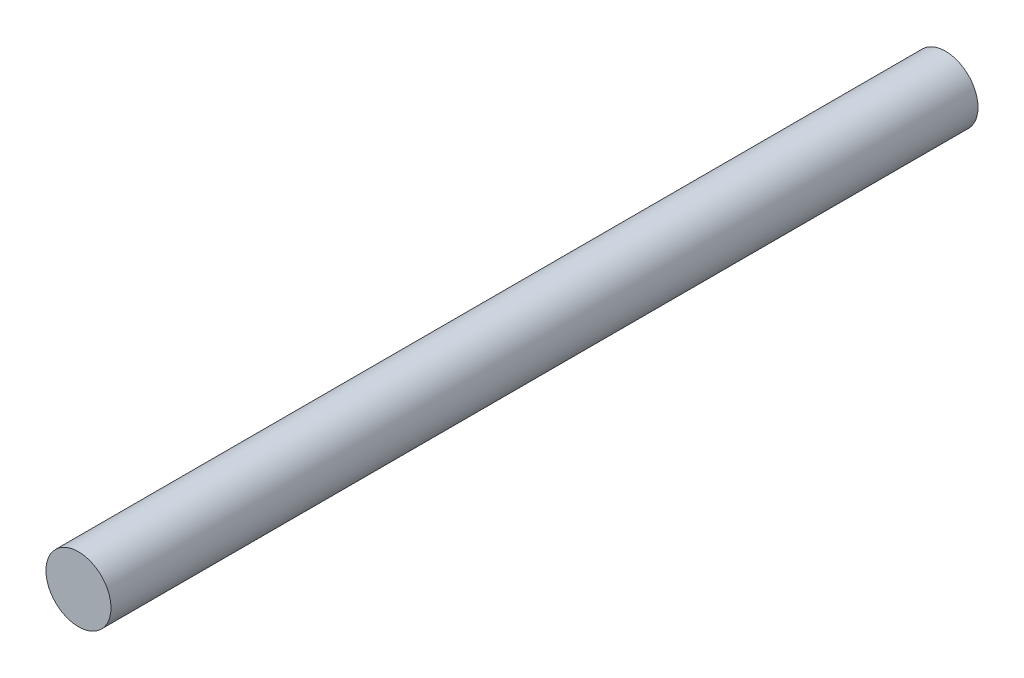
ISO-10303-21;
HEADER;
FILE_DESCRIPTION(('STEP AP214'),'2;1');
FILE_NAME('part.step','',(''),(''),'','','');
FILE_SCHEMA(('AUTOMOTIVE_DESIGN { 1 0 10303 214 1 1 1 1 }'));
ENDSEC;
DATA;
#1=APPLICATION_CONTEXT('core data for automotive mechanical design processes');
#2=APPLICATION_PROTOCOL_DEFINITION('international standard','automotive_design',2000,#1);
#3=PRODUCT_CONTEXT('',#1,'mechanical');
#4=PRODUCT('Part','Part','',(#3));
#5=PRODUCT_RELATED_PRODUCT_CATEGORY('part','',(#4));
#6=PRODUCT_DEFINITION_FORMATION('','',#4);
#7=PRODUCT_DEFINITION_CONTEXT('part definition',#1,'design');
#8=PRODUCT_DEFINITION('design','',#6,#7);
#9=PRODUCT_DEFINITION_SHAPE('','',#8);
#10=(LENGTH_UNIT() NAMED_UNIT(*) SI_UNIT(.MILLI.,.METRE.));
#11=(NAMED_UNIT(*) PLANE_ANGLE_UNIT() SI_UNIT($,.RADIAN.));
#12=(NAMED_UNIT(*) SI_UNIT($,.STERADIAN.) SOLID_ANGLE_UNIT());
#13=UNCERTAINTY_MEASURE_WITH_UNIT(LENGTH_MEASURE(1.E-05),#10,'distance_accuracy_value','');
#14=(GEOMETRIC_REPRESENTATION_CONTEXT(3) GLOBAL_UNCERTAINTY_ASSIGNED_CONTEXT((#13)) GLOBAL_UNIT_ASSIGNED_CONTEXT((#10,
#11,#12)) REPRESENTATION_CONTEXT('',''));
#15=CARTESIAN_POINT('',(0.,0.,0.));
#16=DIRECTION('',(0.,0.,1.));
#17=DIRECTION('',(1.,0.,0.));
#18=AXIS2_PLACEMENT_3D('',#15,#16,#17);
#19=CARTESIAN_POINT('',(0.,0.,40.));
#20=DIRECTION('',(0.,0.,-1.));
#21=DIRECTION('',(-1.,0.,0.));
#22=AXIS2_PLACEMENT_3D('',#19,#20,#21);
#23=CYLINDRICAL_SURFACE('',#22,1.5);
#24=CARTESIAN_POINT('',(0.,0.,40.));
#25=DIRECTION('',(0.,0.,1.));
#26=DIRECTION('',(1.,0.,0.));
#27=AXIS2_PLACEMENT_3D('',#24,#25,#26);
#28=CIRCLE('',#27,1.5);
#29=CARTESIAN_POINT('',(1.5,0.,40.));
#30=VERTEX_POINT('',#29);
#31=EDGE_CURVE('E10',#30,#30,#28,.T.);
#32=ORIENTED_EDGE('',*,*,#31,.F.);
#33=EDGE_LOOP('',(#32));
#34=FACE_BOUND('',#33,.T.);
#35=CARTESIAN_POINT('',(0.,0.,0.));
#36=DIRECTION('',(0.,0.,1.));
#37=DIRECTION('',(1.,0.,0.));
#38=AXIS2_PLACEMENT_3D('',#35,#36,#37);
#39=CIRCLE('',#38,1.5);
#40=CARTESIAN_POINT('',(1.5,0.,0.));
#41=VERTEX_POINT('',#40);
#42=EDGE_CURVE('E35',#41,#41,#39,.T.);
#43=ORIENTED_EDGE('',*,*,#42,.T.);
#44=EDGE_LOOP('',(#43));
#45=FACE_BOUND('',#44,.T.);
#46=ADVANCED_FACE('F32',(#34,#45),#23,.T.);
#47=CARTESIAN_POINT('',(0.,0.,40.));
#48=DIRECTION('',(0.,0.,1.));
#49=DIRECTION('',(1.,0.,0.));
#50=AXIS2_PLACEMENT_3D('',#47,#48,#49);
#51=PLANE('',#50);
#52=ORIENTED_EDGE('',*,*,#31,.T.);
#53=EDGE_LOOP('',(#52));
#54=FACE_BOUND('',#53,.T.);
#55=ADVANCED_FACE('F47',(#54),#51,.T.);
#56=CARTESIAN_POINT('',(0.,0.,0.));
#57=DIRECTION('',(0.,0.,1.));
#58=DIRECTION('',(1.,0.,0.));
#59=AXIS2_PLACEMENT_3D('',#56,#57,#58);
#60=PLANE('',#59);
#61=ORIENTED_EDGE('',*,*,#42,.F.);
#62=EDGE_LOOP('',(#61));
#63=FACE_BOUND('',#62,.T.);
#64=ADVANCED_FACE('F45',(#63),#60,.F.);
#65=CLOSED_SHELL('',(#46,#55,#64));
#66=MANIFOLD_SOLID_BREP('B2',#65);
#67=ADVANCED_BREP_SHAPE_REPRESENTATION('',(#18,#66),#14);
#68=SHAPE_DEFINITION_REPRESENTATION(#9,#67);
ENDSEC;
END-ISO-10303-21;
